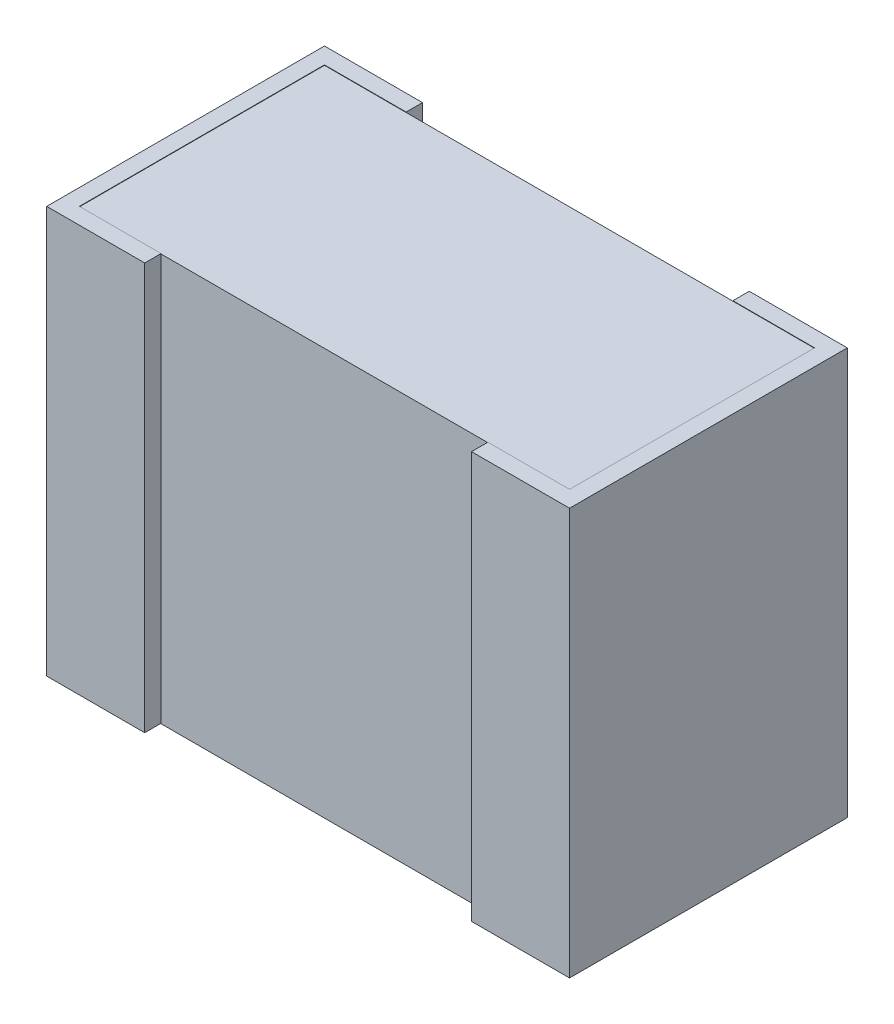
ISO-10303-21;
HEADER;
FILE_DESCRIPTION(('STEP AP214'),'2;1');
FILE_NAME('part.step','',(''),(''),'','','');
FILE_SCHEMA(('AUTOMOTIVE_DESIGN { 1 0 10303 214 1 1 1 1 }'));
ENDSEC;
DATA;
#1=APPLICATION_CONTEXT('core data for automotive mechanical design processes');
#2=APPLICATION_PROTOCOL_DEFINITION('international standard','automotive_design',2000,#1);
#3=PRODUCT_CONTEXT('',#1,'mechanical');
#4=PRODUCT('Part','Part','',(#3));
#5=PRODUCT_RELATED_PRODUCT_CATEGORY('part','',(#4));
#6=PRODUCT_DEFINITION_FORMATION('','',#4);
#7=PRODUCT_DEFINITION_CONTEXT('part definition',#1,'design');
#8=PRODUCT_DEFINITION('design','',#6,#7);
#9=PRODUCT_DEFINITION_SHAPE('','',#8);
#10=(LENGTH_UNIT() NAMED_UNIT(*) SI_UNIT(.MILLI.,.METRE.));
#11=(NAMED_UNIT(*) PLANE_ANGLE_UNIT() SI_UNIT($,.RADIAN.));
#12=(NAMED_UNIT(*) SI_UNIT($,.STERADIAN.) SOLID_ANGLE_UNIT());
#13=UNCERTAINTY_MEASURE_WITH_UNIT(LENGTH_MEASURE(1.E-05),#10,'distance_accuracy_value','');
#14=(GEOMETRIC_REPRESENTATION_CONTEXT(3) GLOBAL_UNCERTAINTY_ASSIGNED_CONTEXT((#13)) GLOBAL_UNIT_ASSIGNED_CONTEXT((#10,
#11,#12)) REPRESENTATION_CONTEXT('',''));
#15=CARTESIAN_POINT('',(0.,0.,0.));
#16=DIRECTION('',(0.,0.,1.));
#17=DIRECTION('',(1.,0.,0.));
#18=AXIS2_PLACEMENT_3D('',#15,#16,#17);
#19=CARTESIAN_POINT('',(-1.6,-1.24246,0.85));
#20=DIRECTION('',(0.,0.,1.));
#21=DIRECTION('',(1.,0.,0.));
#22=AXIS2_PLACEMENT_3D('',#19,#20,#21);
#23=PLANE('',#22);
#24=DIRECTION('',(1.,0.,0.));
#25=VECTOR('',#24,1.);
#26=CARTESIAN_POINT('',(-1.6,-1.24246,0.85));
#27=LINE('',#26,#25);
#28=CARTESIAN_POINT('',(-1.6,-1.24246,0.85));
#29=VERTEX_POINT('',#28);
#30=CARTESIAN_POINT('',(-1.,-1.24246,0.85));
#31=VERTEX_POINT('',#30);
#32=EDGE_CURVE('E255',#29,#31,#27,.T.);
#33=ORIENTED_EDGE('',*,*,#32,.T.);
#34=DIRECTION('',(0.,1.,0.));
#35=VECTOR('',#34,1.);
#36=CARTESIAN_POINT('',(-1.,-1.24246,0.85));
#37=LINE('',#36,#35);
#38=CARTESIAN_POINT('',(-1.,1.24754,0.85));
#39=VERTEX_POINT('',#38);
#40=EDGE_CURVE('E238',#39,#31,#37,.F.);
#41=ORIENTED_EDGE('',*,*,#40,.F.);
#42=DIRECTION('',(1.,0.,0.));
#43=VECTOR('',#42,1.);
#44=CARTESIAN_POINT('',(-1.6,1.24754,0.85));
#45=LINE('',#44,#43);
#46=CARTESIAN_POINT('',(-1.6,1.24754,0.85));
#47=VERTEX_POINT('',#46);
#48=EDGE_CURVE('E271',#47,#39,#45,.T.);
#49=ORIENTED_EDGE('',*,*,#48,.F.);
#50=DIRECTION('',(0.,1.,0.));
#51=VECTOR('',#50,1.);
#52=CARTESIAN_POINT('',(-1.6,-1.24246,0.85));
#53=LINE('',#52,#51);
#54=EDGE_CURVE('E269',#47,#29,#53,.F.);
#55=ORIENTED_EDGE('',*,*,#54,.T.);
#56=EDGE_LOOP('',(#33,#41,#49,#55));
#57=FACE_BOUND('',#56,.T.);
#58=ADVANCED_FACE('F17',(#57),#23,.T.);
#59=CARTESIAN_POINT('',(1.6,-1.24246,0.85));
#60=DIRECTION('',(0.,0.,-1.));
#61=DIRECTION('',(-1.,0.,0.));
#62=AXIS2_PLACEMENT_3D('',#59,#60,#61);
#63=PLANE('',#62);
#64=DIRECTION('',(0.,1.,0.));
#65=VECTOR('',#64,1.);
#66=CARTESIAN_POINT('',(1.,-1.24246,0.85));
#67=LINE('',#66,#65);
#68=CARTESIAN_POINT('',(1.,1.24754,0.85));
#69=VERTEX_POINT('',#68);
#70=CARTESIAN_POINT('',(1.,-1.24246,0.85));
#71=VERTEX_POINT('',#70);
#72=EDGE_CURVE('E212',#69,#71,#67,.F.);
#73=ORIENTED_EDGE('',*,*,#72,.T.);
#74=DIRECTION('',(1.,0.,0.));
#75=VECTOR('',#74,1.);
#76=CARTESIAN_POINT('',(1.6,-1.24246,0.85));
#77=LINE('',#76,#75);
#78=CARTESIAN_POINT('',(1.6,-1.24246,0.85));
#79=VERTEX_POINT('',#78);
#80=EDGE_CURVE('E250',#71,#79,#77,.T.);
#81=ORIENTED_EDGE('',*,*,#80,.T.);
#82=DIRECTION('',(0.,1.,0.));
#83=VECTOR('',#82,1.);
#84=CARTESIAN_POINT('',(1.6,-1.24246,0.85));
#85=LINE('',#84,#83);
#86=CARTESIAN_POINT('',(1.6,1.24754,0.85));
#87=VERTEX_POINT('',#86);
#88=EDGE_CURVE('E229',#87,#79,#85,.F.);
#89=ORIENTED_EDGE('',*,*,#88,.F.);
#90=DIRECTION('',(1.,0.,0.));
#91=VECTOR('',#90,1.);
#92=CARTESIAN_POINT('',(1.6,1.24754,0.85));
#93=LINE('',#92,#91);
#94=EDGE_CURVE('E174',#69,#87,#93,.T.);
#95=ORIENTED_EDGE('',*,*,#94,.F.);
#96=EDGE_LOOP('',(#73,#81,#89,#95));
#97=FACE_BOUND('',#96,.T.);
#98=ADVANCED_FACE('F645',(#97),#63,.F.);
#99=CARTESIAN_POINT('',(1.6,1.24754,0.75));
#100=DIRECTION('',(0.,1.,0.));
#101=DIRECTION('',(0.,0.,1.));
#102=AXIS2_PLACEMENT_3D('',#99,#100,#101);
#103=PLANE('',#102);
#104=DIRECTION('',(1.,0.,0.));
#105=VECTOR('',#104,1.);
#106=CARTESIAN_POINT('',(1.6,1.24754,-0.75));
#107=LINE('',#106,#105);
#108=CARTESIAN_POINT('',(1.,1.24754,-0.75));
#109=VERTEX_POINT('',#108);
#110=CARTESIAN_POINT('',(1.5,1.24754,-0.75));
#111=VERTEX_POINT('',#110);
#112=EDGE_CURVE('E189',#109,#111,#107,.T.);
#113=ORIENTED_EDGE('',*,*,#112,.T.);
#114=DIRECTION('',(0.,0.,1.));
#115=VECTOR('',#114,1.);
#116=CARTESIAN_POINT('',(1.5,1.24754,-0.75));
#117=LINE('',#116,#115);
#118=CARTESIAN_POINT('',(1.5,1.24754,0.75));
#119=VERTEX_POINT('',#118);
#120=EDGE_CURVE('E200',#119,#111,#117,.F.);
#121=ORIENTED_EDGE('',*,*,#120,.F.);
#122=DIRECTION('',(1.,0.,0.));
#123=VECTOR('',#122,1.);
#124=CARTESIAN_POINT('',(1.6,1.24754,0.75));
#125=LINE('',#124,#123);
#126=CARTESIAN_POINT('',(1.,1.24754,0.75));
#127=VERTEX_POINT('',#126);
#128=EDGE_CURVE('E20',#119,#127,#125,.F.);
#129=ORIENTED_EDGE('',*,*,#128,.T.);
#130=DIRECTION('',(0.,0.,-1.));
#131=VECTOR('',#130,1.);
#132=CARTESIAN_POINT('',(1.,1.24754,0.85));
#133=LINE('',#132,#131);
#134=EDGE_CURVE('E198',#127,#69,#133,.F.);
#135=ORIENTED_EDGE('',*,*,#134,.T.);
#136=ORIENTED_EDGE('',*,*,#94,.T.);
#137=DIRECTION('',(0.,0.,-1.));
#138=VECTOR('',#137,1.);
#139=CARTESIAN_POINT('',(1.6,1.24754,0.85));
#140=LINE('',#139,#138);
#141=CARTESIAN_POINT('',(1.6,1.24754,-0.85));
#142=VERTEX_POINT('',#141);
#143=EDGE_CURVE('E170',#142,#87,#140,.F.);
#144=ORIENTED_EDGE('',*,*,#143,.F.);
#145=DIRECTION('',(1.,0.,0.));
#146=VECTOR('',#145,1.);
#147=CARTESIAN_POINT('',(1.6,1.24754,-0.85));
#148=LINE('',#147,#146);
#149=CARTESIAN_POINT('',(1.,1.24754,-0.85));
#150=VERTEX_POINT('',#149);
#151=EDGE_CURVE('E166',#142,#150,#148,.F.);
#152=ORIENTED_EDGE('',*,*,#151,.T.);
#153=DIRECTION('',(0.,0.,1.));
#154=VECTOR('',#153,1.);
#155=CARTESIAN_POINT('',(1.,1.24754,0.75));
#156=LINE('',#155,#154);
#157=EDGE_CURVE('E163',#150,#109,#156,.T.);
#158=ORIENTED_EDGE('',*,*,#157,.T.);
#159=EDGE_LOOP('',(#113,#121,#129,#135,#136,#144,#152,#158));
#160=FACE_BOUND('',#159,.T.);
#161=ADVANCED_FACE('F168',(#160),#103,.T.);
#162=CARTESIAN_POINT('',(-1.6,1.24754,0.75));
#163=DIRECTION('',(0.,1.,0.));
#164=DIRECTION('',(0.,0.,1.));
#165=AXIS2_PLACEMENT_3D('',#162,#163,#164);
#166=PLANE('',#165);
#167=ORIENTED_EDGE('',*,*,#48,.T.);
#168=DIRECTION('',(0.,0.,-1.));
#169=VECTOR('',#168,1.);
#170=CARTESIAN_POINT('',(-1.,1.24754,0.85));
#171=LINE('',#170,#169);
#172=CARTESIAN_POINT('',(-1.,1.24754,0.75));
#173=VERTEX_POINT('',#172);
#174=EDGE_CURVE('E240',#173,#39,#171,.F.);
#175=ORIENTED_EDGE('',*,*,#174,.F.);
#176=DIRECTION('',(1.,0.,0.));
#177=VECTOR('',#176,1.);
#178=CARTESIAN_POINT('',(-1.5,1.24754,0.75));
#179=LINE('',#178,#177);
#180=CARTESIAN_POINT('',(-1.5,1.24754,0.75));
#181=VERTEX_POINT('',#180);
#182=EDGE_CURVE('E221',#173,#181,#179,.F.);
#183=ORIENTED_EDGE('',*,*,#182,.T.);
#184=DIRECTION('',(0.,0.,1.));
#185=VECTOR('',#184,1.);
#186=CARTESIAN_POINT('',(-1.5,1.24754,-0.75));
#187=LINE('',#186,#185);
#188=CARTESIAN_POINT('',(-1.5,1.24754,-0.75));
#189=VERTEX_POINT('',#188);
#190=EDGE_CURVE('E283',#181,#189,#187,.F.);
#191=ORIENTED_EDGE('',*,*,#190,.T.);
#192=DIRECTION('',(1.,0.,0.));
#193=VECTOR('',#192,1.);
#194=CARTESIAN_POINT('',(-1.6,1.24754,-0.75));
#195=LINE('',#194,#193);
#196=CARTESIAN_POINT('',(-1.,1.24754,-0.75));
#197=VERTEX_POINT('',#196);
#198=EDGE_CURVE('E191',#189,#197,#195,.T.);
#199=ORIENTED_EDGE('',*,*,#198,.T.);
#200=DIRECTION('',(0.,0.,1.));
#201=VECTOR('',#200,1.);
#202=CARTESIAN_POINT('',(-1.,1.24754,0.75));
#203=LINE('',#202,#201);
#204=CARTESIAN_POINT('',(-1.,1.24754,-0.85));
#205=VERTEX_POINT('',#204);
#206=EDGE_CURVE('E275',#197,#205,#203,.F.);
#207=ORIENTED_EDGE('',*,*,#206,.T.);
#208=DIRECTION('',(1.,0.,0.));
#209=VECTOR('',#208,1.);
#210=CARTESIAN_POINT('',(-1.6,1.24754,-0.85));
#211=LINE('',#210,#209);
#212=CARTESIAN_POINT('',(-1.6,1.24754,-0.85));
#213=VERTEX_POINT('',#212);
#214=EDGE_CURVE('E273',#205,#213,#211,.F.);
#215=ORIENTED_EDGE('',*,*,#214,.T.);
#216=DIRECTION('',(0.,0.,-1.));
#217=VECTOR('',#216,1.);
#218=CARTESIAN_POINT('',(-1.6,1.24754,0.85));
#219=LINE('',#218,#217);
#220=EDGE_CURVE('E266',#213,#47,#219,.F.);
#221=ORIENTED_EDGE('',*,*,#220,.T.);
#222=EDGE_LOOP('',(#167,#175,#183,#191,#199,#207,#215,#221));
#223=FACE_BOUND('',#222,.T.);
#224=ADVANCED_FACE('F279',(#223),#166,.T.);
#225=CARTESIAN_POINT('',(-1.6,-1.24246,0.85));
#226=DIRECTION('',(1.,0.,0.));
#227=DIRECTION('',(0.,0.,-1.));
#228=AXIS2_PLACEMENT_3D('',#225,#226,#227);
#229=PLANE('',#228);
#230=DIRECTION('',(0.,1.,0.));
#231=VECTOR('',#230,1.);
#232=CARTESIAN_POINT('',(-1.6,-1.24246,-0.85));
#233=LINE('',#232,#231);
#234=CARTESIAN_POINT('',(-1.6,-1.24246,-0.85));
#235=VERTEX_POINT('',#234);
#236=EDGE_CURVE('E308',#235,#213,#233,.T.);
#237=ORIENTED_EDGE('',*,*,#236,.F.);
#238=DIRECTION('',(0.,0.,1.));
#239=VECTOR('',#238,1.);
#240=CARTESIAN_POINT('',(-1.6,-1.24246,0.75));
#241=LINE('',#240,#239);
#242=EDGE_CURVE('E258',#235,#29,#241,.T.);
#243=ORIENTED_EDGE('',*,*,#242,.T.);
#244=ORIENTED_EDGE('',*,*,#54,.F.);
#245=ORIENTED_EDGE('',*,*,#220,.F.);
#246=EDGE_LOOP('',(#237,#243,#244,#245));
#247=FACE_BOUND('',#246,.T.);
#248=ADVANCED_FACE('F311',(#247),#229,.F.);
#249=CARTESIAN_POINT('',(-1.6,-1.24246,0.75));
#250=DIRECTION('',(0.,1.,0.));
#251=DIRECTION('',(0.,0.,1.));
#252=AXIS2_PLACEMENT_3D('',#249,#250,#251);
#253=PLANE('',#252);
#254=DIRECTION('',(0.,0.,-1.));
#255=VECTOR('',#254,1.);
#256=CARTESIAN_POINT('',(-1.,-1.24246,0.85));
#257=LINE('',#256,#255);
#258=CARTESIAN_POINT('',(-1.,-1.24246,0.75));
#259=VERTEX_POINT('',#258);
#260=EDGE_CURVE('E235',#31,#259,#257,.T.);
#261=ORIENTED_EDGE('',*,*,#260,.F.);
#262=ORIENTED_EDGE('',*,*,#32,.F.);
#263=ORIENTED_EDGE('',*,*,#242,.F.);
#264=DIRECTION('',(-1.,0.,0.));
#265=VECTOR('',#264,1.);
#266=CARTESIAN_POINT('',(-1.,-1.24246,-0.85));
#267=LINE('',#266,#265);
#268=CARTESIAN_POINT('',(-1.,-1.24246,-0.85));
#269=VERTEX_POINT('',#268);
#270=EDGE_CURVE('E335',#269,#235,#267,.T.);
#271=ORIENTED_EDGE('',*,*,#270,.F.);
#272=DIRECTION('',(0.,0.,1.));
#273=VECTOR('',#272,1.);
#274=CARTESIAN_POINT('',(-1.,-1.24246,0.75));
#275=LINE('',#274,#273);
#276=CARTESIAN_POINT('',(-1.,-1.24246,-0.75));
#277=VERTEX_POINT('',#276);
#278=EDGE_CURVE('E261',#277,#269,#275,.F.);
#279=ORIENTED_EDGE('',*,*,#278,.F.);
#280=DIRECTION('',(1.,0.,0.));
#281=VECTOR('',#280,1.);
#282=CARTESIAN_POINT('',(-1.6,-1.24246,-0.75));
#283=LINE('',#282,#281);
#284=CARTESIAN_POINT('',(-1.5,-1.24246,-0.75));
#285=VERTEX_POINT('',#284);
#286=EDGE_CURVE('E263',#285,#277,#283,.T.);
#287=ORIENTED_EDGE('',*,*,#286,.F.);
#288=DIRECTION('',(0.,0.,1.));
#289=VECTOR('',#288,1.);
#290=CARTESIAN_POINT('',(-1.5,-1.24246,0.75));
#291=LINE('',#290,#289);
#292=CARTESIAN_POINT('',(-1.5,-1.24246,0.75));
#293=VERTEX_POINT('',#292);
#294=EDGE_CURVE('E338',#293,#285,#291,.F.);
#295=ORIENTED_EDGE('',*,*,#294,.F.);
#296=DIRECTION('',(1.,0.,0.));
#297=VECTOR('',#296,1.);
#298=CARTESIAN_POINT('',(-1.6,-1.24246,0.75));
#299=LINE('',#298,#297);
#300=EDGE_CURVE('E253',#259,#293,#299,.F.);
#301=ORIENTED_EDGE('',*,*,#300,.F.);
#302=EDGE_LOOP('',(#261,#262,#263,#271,#279,#287,#295,#301));
#303=FACE_BOUND('',#302,.T.);
#304=ADVANCED_FACE('F399',(#303),#253,.F.);
#305=CARTESIAN_POINT('',(1.6,-1.24246,0.75));
#306=DIRECTION('',(0.,1.,0.));
#307=DIRECTION('',(0.,0.,1.));
#308=AXIS2_PLACEMENT_3D('',#305,#306,#307);
#309=PLANE('',#308);
#310=DIRECTION('',(0.,0.,-1.));
#311=VECTOR('',#310,1.);
#312=CARTESIAN_POINT('',(1.5,-1.24246,-0.75));
#313=LINE('',#312,#311);
#314=CARTESIAN_POINT('',(1.5,-1.24246,-0.75));
#315=VERTEX_POINT('',#314);
#316=CARTESIAN_POINT('',(1.5,-1.24246,0.75));
#317=VERTEX_POINT('',#316);
#318=EDGE_CURVE('E344',#315,#317,#313,.F.);
#319=ORIENTED_EDGE('',*,*,#318,.F.);
#320=DIRECTION('',(1.,0.,0.));
#321=VECTOR('',#320,1.);
#322=CARTESIAN_POINT('',(1.6,-1.24246,-0.75));
#323=LINE('',#322,#321);
#324=CARTESIAN_POINT('',(1.,-1.24246,-0.75));
#325=VERTEX_POINT('',#324);
#326=EDGE_CURVE('E245',#325,#315,#323,.T.);
#327=ORIENTED_EDGE('',*,*,#326,.F.);
#328=DIRECTION('',(0.,0.,1.));
#329=VECTOR('',#328,1.);
#330=CARTESIAN_POINT('',(1.,-1.24246,0.75));
#331=LINE('',#330,#329);
#332=CARTESIAN_POINT('',(1.,-1.24246,-0.85));
#333=VERTEX_POINT('',#332);
#334=EDGE_CURVE('E247',#333,#325,#331,.T.);
#335=ORIENTED_EDGE('',*,*,#334,.F.);
#336=DIRECTION('',(1.,0.,0.));
#337=VECTOR('',#336,1.);
#338=CARTESIAN_POINT('',(1.6,-1.24246,-0.85));
#339=LINE('',#338,#337);
#340=CARTESIAN_POINT('',(1.6,-1.24246,-0.85));
#341=VERTEX_POINT('',#340);
#342=EDGE_CURVE('E180',#341,#333,#339,.F.);
#343=ORIENTED_EDGE('',*,*,#342,.F.);
#344=DIRECTION('',(0.,0.,-1.));
#345=VECTOR('',#344,1.);
#346=CARTESIAN_POINT('',(1.6,-1.24246,0.85));
#347=LINE('',#346,#345);
#348=EDGE_CURVE('E223',#79,#341,#347,.T.);
#349=ORIENTED_EDGE('',*,*,#348,.F.);
#350=ORIENTED_EDGE('',*,*,#80,.F.);
#351=DIRECTION('',(0.,0.,-1.));
#352=VECTOR('',#351,1.);
#353=CARTESIAN_POINT('',(1.,-1.24246,0.85));
#354=LINE('',#353,#352);
#355=CARTESIAN_POINT('',(1.,-1.24246,0.75));
#356=VERTEX_POINT('',#355);
#357=EDGE_CURVE('E213',#71,#356,#354,.T.);
#358=ORIENTED_EDGE('',*,*,#357,.T.);
#359=DIRECTION('',(1.,0.,0.));
#360=VECTOR('',#359,1.);
#361=CARTESIAN_POINT('',(1.6,-1.24246,0.75));
#362=LINE('',#361,#360);
#363=EDGE_CURVE('E243',#317,#356,#362,.F.);
#364=ORIENTED_EDGE('',*,*,#363,.F.);
#365=EDGE_LOOP('',(#319,#327,#335,#343,#349,#350,#358,#364));
#366=FACE_BOUND('',#365,.T.);
#367=ADVANCED_FACE('F410',(#366),#309,.F.);
#368=CARTESIAN_POINT('',(-1.,-1.24246,0.85));
#369=DIRECTION('',(1.,0.,0.));
#370=DIRECTION('',(0.,0.,-1.));
#371=AXIS2_PLACEMENT_3D('',#368,#369,#370);
#372=PLANE('',#371);
#373=DIRECTION('',(0.,1.,0.));
#374=VECTOR('',#373,1.);
#375=CARTESIAN_POINT('',(-1.,1.245,0.75));
#376=LINE('',#375,#374);
#377=CARTESIAN_POINT('',(-1.,1.245,0.75));
#378=VERTEX_POINT('',#377);
#379=EDGE_CURVE('E323',#259,#378,#376,.T.);
#380=ORIENTED_EDGE('',*,*,#379,.T.);
#381=DIRECTION('',(0.,1.,0.));
#382=VECTOR('',#381,1.);
#383=CARTESIAN_POINT('',(-1.,-1.24246,0.75));
#384=LINE('',#383,#382);
#385=EDGE_CURVE('E321',#378,#173,#384,.T.);
#386=ORIENTED_EDGE('',*,*,#385,.T.);
#387=ORIENTED_EDGE('',*,*,#174,.T.);
#388=ORIENTED_EDGE('',*,*,#40,.T.);
#389=ORIENTED_EDGE('',*,*,#260,.T.);
#390=EDGE_LOOP('',(#380,#386,#387,#388,#389));
#391=FACE_BOUND('',#390,.T.);
#392=ADVANCED_FACE('F320',(#391),#372,.T.);
#393=CARTESIAN_POINT('',(1.,-1.24246,0.85));
#394=DIRECTION('',(1.,0.,0.));
#395=DIRECTION('',(0.,0.,-1.));
#396=AXIS2_PLACEMENT_3D('',#393,#394,#395);
#397=PLANE('',#396);
#398=DIRECTION('',(0.,1.,0.));
#399=VECTOR('',#398,1.);
#400=CARTESIAN_POINT('',(1.,-1.24246,0.75));
#401=LINE('',#400,#399);
#402=CARTESIAN_POINT('',(1.,1.245,0.75));
#403=VERTEX_POINT('',#402);
#404=EDGE_CURVE('E208',#403,#127,#401,.T.);
#405=ORIENTED_EDGE('',*,*,#404,.F.);
#406=DIRECTION('',(0.,1.,0.));
#407=VECTOR('',#406,1.);
#408=CARTESIAN_POINT('',(1.,1.245,0.75));
#409=LINE('',#408,#407);
#410=EDGE_CURVE('E354',#403,#356,#409,.F.);
#411=ORIENTED_EDGE('',*,*,#410,.T.);
#412=ORIENTED_EDGE('',*,*,#357,.F.);
#413=ORIENTED_EDGE('',*,*,#72,.F.);
#414=ORIENTED_EDGE('',*,*,#134,.F.);
#415=EDGE_LOOP('',(#405,#411,#412,#413,#414));
#416=FACE_BOUND('',#415,.T.);
#417=ADVANCED_FACE('F206',(#416),#397,.F.);
#418=CARTESIAN_POINT('',(1.6,-1.24246,0.85));
#419=DIRECTION('',(1.,0.,0.));
#420=DIRECTION('',(0.,0.,-1.));
#421=AXIS2_PLACEMENT_3D('',#418,#419,#420);
#422=PLANE('',#421);
#423=ORIENTED_EDGE('',*,*,#348,.T.);
#424=DIRECTION('',(0.,1.,0.));
#425=VECTOR('',#424,1.);
#426=CARTESIAN_POINT('',(1.6,-1.24246,-0.85));
#427=LINE('',#426,#425);
#428=EDGE_CURVE('E359',#341,#142,#427,.T.);
#429=ORIENTED_EDGE('',*,*,#428,.T.);
#430=ORIENTED_EDGE('',*,*,#143,.T.);
#431=ORIENTED_EDGE('',*,*,#88,.T.);
#432=EDGE_LOOP('',(#423,#429,#430,#431));
#433=FACE_BOUND('',#432,.T.);
#434=ADVANCED_FACE('F586',(#433),#422,.T.);
#435=CARTESIAN_POINT('',(1.5,-1.24246,-0.75));
#436=DIRECTION('',(-1.,0.,0.));
#437=DIRECTION('',(0.,0.,1.));
#438=AXIS2_PLACEMENT_3D('',#435,#436,#437);
#439=PLANE('',#438);
#440=ORIENTED_EDGE('',*,*,#120,.T.);
#441=DIRECTION('',(0.,1.,0.));
#442=VECTOR('',#441,1.);
#443=CARTESIAN_POINT('',(1.5,-1.24246,-0.75));
#444=LINE('',#443,#442);
#445=CARTESIAN_POINT('',(1.5,1.245,-0.75));
#446=VERTEX_POINT('',#445);
#447=EDGE_CURVE('E356',#446,#111,#444,.T.);
#448=ORIENTED_EDGE('',*,*,#447,.F.);
#449=DIRECTION('',(0.,0.,-1.));
#450=VECTOR('',#449,1.);
#451=CARTESIAN_POINT('',(1.5,1.245,0.75));
#452=LINE('',#451,#450);
#453=CARTESIAN_POINT('',(1.5,1.245,0.75));
#454=VERTEX_POINT('',#453);
#455=EDGE_CURVE('E365',#446,#454,#452,.F.);
#456=ORIENTED_EDGE('',*,*,#455,.T.);
#457=DIRECTION('',(0.,1.,0.));
#458=VECTOR('',#457,1.);
#459=CARTESIAN_POINT('',(1.5,-1.24246,0.75));
#460=LINE('',#459,#458);
#461=EDGE_CURVE('E219',#119,#454,#460,.F.);
#462=ORIENTED_EDGE('',*,*,#461,.F.);
#463=EDGE_LOOP('',(#440,#448,#456,#462));
#464=FACE_BOUND('',#463,.T.);
#465=ADVANCED_FACE('F578',(#464),#439,.T.);
#466=CARTESIAN_POINT('',(1.5,-1.24246,0.75));
#467=DIRECTION('',(0.,0.,-1.));
#468=DIRECTION('',(-1.,0.,0.));
#469=AXIS2_PLACEMENT_3D('',#466,#467,#468);
#470=PLANE('',#469);
#471=ORIENTED_EDGE('',*,*,#128,.F.);
#472=ORIENTED_EDGE('',*,*,#461,.T.);
#473=DIRECTION('',(1.,0.,0.));
#474=VECTOR('',#473,1.);
#475=CARTESIAN_POINT('',(-1.5,1.245,0.75));
#476=LINE('',#475,#474);
#477=EDGE_CURVE('E218',#454,#403,#476,.F.);
#478=ORIENTED_EDGE('',*,*,#477,.T.);
#479=ORIENTED_EDGE('',*,*,#404,.T.);
#480=EDGE_LOOP('',(#471,#472,#478,#479));
#481=FACE_BOUND('',#480,.T.);
#482=ADVANCED_FACE('F216',(#481),#470,.T.);
#483=CARTESIAN_POINT('',(-1.5,-1.24246,0.75));
#484=DIRECTION('',(0.,0.,1.));
#485=DIRECTION('',(1.,0.,0.));
#486=AXIS2_PLACEMENT_3D('',#483,#484,#485);
#487=PLANE('',#486);
#488=DIRECTION('',(1.,0.,0.));
#489=VECTOR('',#488,1.);
#490=CARTESIAN_POINT('',(-1.5,1.245,0.75));
#491=LINE('',#490,#489);
#492=CARTESIAN_POINT('',(-1.5,1.245,0.75));
#493=VERTEX_POINT('',#492);
#494=EDGE_CURVE('E372',#378,#493,#491,.F.);
#495=ORIENTED_EDGE('',*,*,#494,.T.);
#496=DIRECTION('',(0.,1.,0.));
#497=VECTOR('',#496,1.);
#498=CARTESIAN_POINT('',(-1.5,-1.24246,0.75));
#499=LINE('',#498,#497);
#500=EDGE_CURVE('E328',#493,#181,#499,.T.);
#501=ORIENTED_EDGE('',*,*,#500,.T.);
#502=ORIENTED_EDGE('',*,*,#182,.F.);
#503=ORIENTED_EDGE('',*,*,#385,.F.);
#504=EDGE_LOOP('',(#495,#501,#502,#503));
#505=FACE_BOUND('',#504,.T.);
#506=ADVANCED_FACE('F417',(#505),#487,.F.);
#507=CARTESIAN_POINT('',(-1.5,-1.24246,-0.75));
#508=DIRECTION('',(-1.,0.,0.));
#509=DIRECTION('',(0.,0.,1.));
#510=AXIS2_PLACEMENT_3D('',#507,#508,#509);
#511=PLANE('',#510);
#512=DIRECTION('',(0.,0.,-1.));
#513=VECTOR('',#512,1.);
#514=CARTESIAN_POINT('',(-1.5,1.245,0.75));
#515=LINE('',#514,#513);
#516=CARTESIAN_POINT('',(-1.5,1.245,-0.75));
#517=VERTEX_POINT('',#516);
#518=EDGE_CURVE('E295',#493,#517,#515,.T.);
#519=ORIENTED_EDGE('',*,*,#518,.T.);
#520=DIRECTION('',(0.,1.,0.));
#521=VECTOR('',#520,1.);
#522=CARTESIAN_POINT('',(-1.5,-1.24246,-0.75));
#523=LINE('',#522,#521);
#524=EDGE_CURVE('E333',#517,#189,#523,.T.);
#525=ORIENTED_EDGE('',*,*,#524,.T.);
#526=ORIENTED_EDGE('',*,*,#190,.F.);
#527=ORIENTED_EDGE('',*,*,#500,.F.);
#528=EDGE_LOOP('',(#519,#525,#526,#527));
#529=FACE_BOUND('',#528,.T.);
#530=ADVANCED_FACE('F419',(#529),#511,.F.);
#531=CARTESIAN_POINT('',(-1.,-1.24246,-0.75));
#532=DIRECTION('',(0.,0.,-1.));
#533=DIRECTION('',(-1.,0.,0.));
#534=AXIS2_PLACEMENT_3D('',#531,#532,#533);
#535=PLANE('',#534);
#536=DIRECTION('',(1.,0.,0.));
#537=VECTOR('',#536,1.);
#538=CARTESIAN_POINT('',(-1.5,1.245,-0.75));
#539=LINE('',#538,#537);
#540=CARTESIAN_POINT('',(-1.,1.245,-0.75));
#541=VERTEX_POINT('',#540);
#542=EDGE_CURVE('E290',#517,#541,#539,.T.);
#543=ORIENTED_EDGE('',*,*,#542,.T.);
#544=DIRECTION('',(0.,1.,0.));
#545=VECTOR('',#544,1.);
#546=CARTESIAN_POINT('',(-1.,-1.24246,-0.75));
#547=LINE('',#546,#545);
#548=EDGE_CURVE('E287',#197,#541,#547,.F.);
#549=ORIENTED_EDGE('',*,*,#548,.F.);
#550=ORIENTED_EDGE('',*,*,#198,.F.);
#551=ORIENTED_EDGE('',*,*,#524,.F.);
#552=EDGE_LOOP('',(#543,#549,#550,#551));
#553=FACE_BOUND('',#552,.T.);
#554=ADVANCED_FACE('F288',(#553),#535,.F.);
#555=CARTESIAN_POINT('',(-1.,-1.24246,-0.85));
#556=DIRECTION('',(0.,0.,-1.));
#557=DIRECTION('',(-1.,0.,0.));
#558=AXIS2_PLACEMENT_3D('',#555,#556,#557);
#559=PLANE('',#558);
#560=ORIENTED_EDGE('',*,*,#270,.T.);
#561=ORIENTED_EDGE('',*,*,#236,.T.);
#562=ORIENTED_EDGE('',*,*,#214,.F.);
#563=DIRECTION('',(0.,1.,0.));
#564=VECTOR('',#563,1.);
#565=CARTESIAN_POINT('',(-1.,-1.24246,-0.85));
#566=LINE('',#565,#564);
#567=EDGE_CURVE('E294',#269,#205,#566,.T.);
#568=ORIENTED_EDGE('',*,*,#567,.F.);
#569=EDGE_LOOP('',(#560,#561,#562,#568));
#570=FACE_BOUND('',#569,.T.);
#571=ADVANCED_FACE('F306',(#570),#559,.T.);
#572=CARTESIAN_POINT('',(-1.5,1.245,0.75));
#573=DIRECTION('',(-1.,0.,0.));
#574=DIRECTION('',(0.,0.,1.));
#575=AXIS2_PLACEMENT_3D('',#572,#573,#574);
#576=PLANE('',#575);
#577=DIRECTION('',(0.,1.,0.));
#578=VECTOR('',#577,1.);
#579=CARTESIAN_POINT('',(-1.5,1.245,-0.75));
#580=LINE('',#579,#578);
#581=CARTESIAN_POINT('',(-1.5,-1.245,-0.75));
#582=VERTEX_POINT('',#581);
#583=EDGE_CURVE('E341',#285,#582,#580,.F.);
#584=ORIENTED_EDGE('',*,*,#583,.T.);
#585=DIRECTION('',(0.,0.,-1.));
#586=VECTOR('',#585,1.);
#587=CARTESIAN_POINT('',(-1.5,-1.245,0.75));
#588=LINE('',#587,#586);
#589=CARTESIAN_POINT('',(-1.5,-1.245,0.75));
#590=VERTEX_POINT('',#589);
#591=EDGE_CURVE('E303',#590,#582,#588,.T.);
#592=ORIENTED_EDGE('',*,*,#591,.F.);
#593=DIRECTION('',(0.,1.,0.));
#594=VECTOR('',#593,1.);
#595=CARTESIAN_POINT('',(-1.5,1.245,0.75));
#596=LINE('',#595,#594);
#597=EDGE_CURVE('E350',#590,#293,#596,.T.);
#598=ORIENTED_EDGE('',*,*,#597,.T.);
#599=ORIENTED_EDGE('',*,*,#294,.T.);
#600=EDGE_LOOP('',(#584,#592,#598,#599));
#601=FACE_BOUND('',#600,.T.);
#602=ADVANCED_FACE('F395',(#601),#576,.T.);
#603=CARTESIAN_POINT('',(1.5,1.245,-0.75));
#604=DIRECTION('',(1.,0.,0.));
#605=DIRECTION('',(0.,0.,-1.));
#606=AXIS2_PLACEMENT_3D('',#603,#604,#605);
#607=PLANE('',#606);
#608=DIRECTION('',(0.,1.,0.));
#609=VECTOR('',#608,1.);
#610=CARTESIAN_POINT('',(1.5,1.245,0.75));
#611=LINE('',#610,#609);
#612=CARTESIAN_POINT('',(1.5,-1.245,0.75));
#613=VERTEX_POINT('',#612);
#614=EDGE_CURVE('E347',#317,#613,#611,.F.);
#615=ORIENTED_EDGE('',*,*,#614,.T.);
#616=DIRECTION('',(0.,0.,-1.));
#617=VECTOR('',#616,1.);
#618=CARTESIAN_POINT('',(1.5,-1.245,0.75));
#619=LINE('',#618,#617);
#620=CARTESIAN_POINT('',(1.5,-1.245,-0.75));
#621=VERTEX_POINT('',#620);
#622=EDGE_CURVE('E378',#621,#613,#619,.F.);
#623=ORIENTED_EDGE('',*,*,#622,.F.);
#624=DIRECTION('',(0.,1.,0.));
#625=VECTOR('',#624,1.);
#626=CARTESIAN_POINT('',(1.5,1.245,-0.75));
#627=LINE('',#626,#625);
#628=EDGE_CURVE('E35',#621,#315,#627,.T.);
#629=ORIENTED_EDGE('',*,*,#628,.T.);
#630=ORIENTED_EDGE('',*,*,#318,.T.);
#631=EDGE_LOOP('',(#615,#623,#629,#630));
#632=FACE_BOUND('',#631,.T.);
#633=ADVANCED_FACE('F413',(#632),#607,.T.);
#634=CARTESIAN_POINT('',(-1.5,1.245,0.75));
#635=DIRECTION('',(0.,0.,-1.));
#636=DIRECTION('',(-1.,0.,0.));
#637=AXIS2_PLACEMENT_3D('',#634,#635,#636);
#638=PLANE('',#637);
#639=DIRECTION('',(1.,0.,0.));
#640=VECTOR('',#639,1.);
#641=CARTESIAN_POINT('',(-1.5,1.245,0.75));
#642=LINE('',#641,#640);
#643=EDGE_CURVE('E369',#403,#378,#642,.F.);
#644=ORIENTED_EDGE('',*,*,#643,.T.);
#645=ORIENTED_EDGE('',*,*,#379,.F.);
#646=ORIENTED_EDGE('',*,*,#300,.T.);
#647=ORIENTED_EDGE('',*,*,#597,.F.);
#648=DIRECTION('',(1.,0.,0.));
#649=VECTOR('',#648,1.);
#650=CARTESIAN_POINT('',(-1.5,-1.245,0.75));
#651=LINE('',#650,#649);
#652=EDGE_CURVE('E380',#613,#590,#651,.F.);
#653=ORIENTED_EDGE('',*,*,#652,.F.);
#654=ORIENTED_EDGE('',*,*,#614,.F.);
#655=ORIENTED_EDGE('',*,*,#363,.T.);
#656=ORIENTED_EDGE('',*,*,#410,.F.);
#657=EDGE_LOOP('',(#644,#645,#646,#647,#653,#654,#655,#656));
#658=FACE_BOUND('',#657,.T.);
#659=ADVANCED_FACE('F416',(#658),#638,.F.);
#660=CARTESIAN_POINT('',(1.,-1.24246,-0.75));
#661=DIRECTION('',(0.,0.,1.));
#662=DIRECTION('',(1.,0.,0.));
#663=AXIS2_PLACEMENT_3D('',#660,#661,#662);
#664=PLANE('',#663);
#665=ORIENTED_EDGE('',*,*,#112,.F.);
#666=DIRECTION('',(0.,1.,0.));
#667=VECTOR('',#666,1.);
#668=CARTESIAN_POINT('',(1.,-1.24246,-0.75));
#669=LINE('',#668,#667);
#670=CARTESIAN_POINT('',(1.,1.245,-0.75));
#671=VERTEX_POINT('',#670);
#672=EDGE_CURVE('E184',#109,#671,#669,.F.);
#673=ORIENTED_EDGE('',*,*,#672,.T.);
#674=DIRECTION('',(1.,0.,0.));
#675=VECTOR('',#674,1.);
#676=CARTESIAN_POINT('',(-1.5,1.245,-0.75));
#677=LINE('',#676,#675);
#678=EDGE_CURVE('E362',#671,#446,#677,.T.);
#679=ORIENTED_EDGE('',*,*,#678,.T.);
#680=ORIENTED_EDGE('',*,*,#447,.T.);
#681=EDGE_LOOP('',(#665,#673,#679,#680));
#682=FACE_BOUND('',#681,.T.);
#683=ADVANCED_FACE('F407',(#682),#664,.T.);
#684=CARTESIAN_POINT('',(1.,-1.24246,-0.85));
#685=DIRECTION('',(0.,0.,1.));
#686=DIRECTION('',(1.,0.,0.));
#687=AXIS2_PLACEMENT_3D('',#684,#685,#686);
#688=PLANE('',#687);
#689=ORIENTED_EDGE('',*,*,#428,.F.);
#690=ORIENTED_EDGE('',*,*,#342,.T.);
#691=DIRECTION('',(0.,1.,0.));
#692=VECTOR('',#691,1.);
#693=CARTESIAN_POINT('',(1.,-1.24246,-0.85));
#694=LINE('',#693,#692);
#695=EDGE_CURVE('E178',#333,#150,#694,.T.);
#696=ORIENTED_EDGE('',*,*,#695,.T.);
#697=ORIENTED_EDGE('',*,*,#151,.F.);
#698=EDGE_LOOP('',(#689,#690,#696,#697));
#699=FACE_BOUND('',#698,.T.);
#700=ADVANCED_FACE('F179',(#699),#688,.F.);
#701=CARTESIAN_POINT('',(-1.5,1.245,0.75));
#702=DIRECTION('',(0.,-1.,0.));
#703=DIRECTION('',(0.,0.,-1.));
#704=AXIS2_PLACEMENT_3D('',#701,#702,#703);
#705=PLANE('',#704);
#706=ORIENTED_EDGE('',*,*,#494,.F.);
#707=ORIENTED_EDGE('',*,*,#643,.F.);
#708=ORIENTED_EDGE('',*,*,#477,.F.);
#709=ORIENTED_EDGE('',*,*,#455,.F.);
#710=ORIENTED_EDGE('',*,*,#678,.F.);
#711=DIRECTION('',(1.,0.,0.));
#712=VECTOR('',#711,1.);
#713=CARTESIAN_POINT('',(1.5,1.245,-0.75));
#714=LINE('',#713,#712);
#715=EDGE_CURVE('E183',#671,#541,#714,.F.);
#716=ORIENTED_EDGE('',*,*,#715,.T.);
#717=ORIENTED_EDGE('',*,*,#542,.F.);
#718=ORIENTED_EDGE('',*,*,#518,.F.);
#719=EDGE_LOOP('',(#706,#707,#708,#709,#710,#716,#717,#718));
#720=FACE_BOUND('',#719,.T.);
#721=ADVANCED_FACE('F403',(#720),#705,.F.);
#722=CARTESIAN_POINT('',(-1.,-1.24246,-0.75));
#723=DIRECTION('',(1.,0.,0.));
#724=DIRECTION('',(0.,0.,-1.));
#725=AXIS2_PLACEMENT_3D('',#722,#723,#724);
#726=PLANE('',#725);
#727=ORIENTED_EDGE('',*,*,#278,.T.);
#728=ORIENTED_EDGE('',*,*,#567,.T.);
#729=ORIENTED_EDGE('',*,*,#206,.F.);
#730=ORIENTED_EDGE('',*,*,#548,.T.);
#731=DIRECTION('',(0.,1.,0.));
#732=VECTOR('',#731,1.);
#733=CARTESIAN_POINT('',(-1.,1.245,-0.75));
#734=LINE('',#733,#732);
#735=EDGE_CURVE('E386',#541,#277,#734,.F.);
#736=ORIENTED_EDGE('',*,*,#735,.T.);
#737=EDGE_LOOP('',(#727,#728,#729,#730,#736));
#738=FACE_BOUND('',#737,.T.);
#739=ADVANCED_FACE('F297',(#738),#726,.T.);
#740=CARTESIAN_POINT('',(-1.5,-1.245,0.75));
#741=DIRECTION('',(0.,-1.,0.));
#742=DIRECTION('',(0.,0.,-1.));
#743=AXIS2_PLACEMENT_3D('',#740,#741,#742);
#744=PLANE('',#743);
#745=ORIENTED_EDGE('',*,*,#622,.T.);
#746=ORIENTED_EDGE('',*,*,#652,.T.);
#747=ORIENTED_EDGE('',*,*,#591,.T.);
#748=DIRECTION('',(1.,0.,0.));
#749=VECTOR('',#748,1.);
#750=CARTESIAN_POINT('',(1.5,-1.245,-0.75));
#751=LINE('',#750,#749);
#752=EDGE_CURVE('E26',#582,#621,#751,.T.);
#753=ORIENTED_EDGE('',*,*,#752,.T.);
#754=EDGE_LOOP('',(#745,#746,#747,#753));
#755=FACE_BOUND('',#754,.T.);
#756=ADVANCED_FACE('F390',(#755),#744,.T.);
#757=CARTESIAN_POINT('',(1.,-1.24246,-0.75));
#758=DIRECTION('',(1.,0.,0.));
#759=DIRECTION('',(0.,0.,-1.));
#760=AXIS2_PLACEMENT_3D('',#757,#758,#759);
#761=PLANE('',#760);
#762=ORIENTED_EDGE('',*,*,#695,.F.);
#763=ORIENTED_EDGE('',*,*,#334,.T.);
#764=DIRECTION('',(0.,1.,0.));
#765=VECTOR('',#764,1.);
#766=CARTESIAN_POINT('',(1.,1.245,-0.75));
#767=LINE('',#766,#765);
#768=EDGE_CURVE('E11',#325,#671,#767,.T.);
#769=ORIENTED_EDGE('',*,*,#768,.T.);
#770=ORIENTED_EDGE('',*,*,#672,.F.);
#771=ORIENTED_EDGE('',*,*,#157,.F.);
#772=EDGE_LOOP('',(#762,#763,#769,#770,#771));
#773=FACE_BOUND('',#772,.T.);
#774=ADVANCED_FACE('F186',(#773),#761,.F.);
#775=CARTESIAN_POINT('',(1.5,1.245,-0.75));
#776=DIRECTION('',(0.,0.,1.));
#777=DIRECTION('',(1.,0.,0.));
#778=AXIS2_PLACEMENT_3D('',#775,#776,#777);
#779=PLANE('',#778);
#780=ORIENTED_EDGE('',*,*,#326,.T.);
#781=ORIENTED_EDGE('',*,*,#628,.F.);
#782=ORIENTED_EDGE('',*,*,#752,.F.);
#783=ORIENTED_EDGE('',*,*,#583,.F.);
#784=ORIENTED_EDGE('',*,*,#286,.T.);
#785=ORIENTED_EDGE('',*,*,#735,.F.);
#786=ORIENTED_EDGE('',*,*,#715,.F.);
#787=ORIENTED_EDGE('',*,*,#768,.F.);
#788=EDGE_LOOP('',(#780,#781,#782,#783,#784,#785,#786,#787));
#789=FACE_BOUND('',#788,.T.);
#790=ADVANCED_FACE('F393',(#789),#779,.F.);
#791=CLOSED_SHELL('',(#58,#98,#161,#224,#248,#304,#367,#392,#417,#434,#465,#482,#506,#530,#554,
#571,#602,#633,#659,#683,#700,#721,#739,#756,#774,#790));
#792=MANIFOLD_SOLID_BREP('B1',#791);
#793=ADVANCED_BREP_SHAPE_REPRESENTATION('',(#18,#792),#14);
#794=SHAPE_DEFINITION_REPRESENTATION(#9,#793);
ENDSEC;
END-ISO-10303-21;
